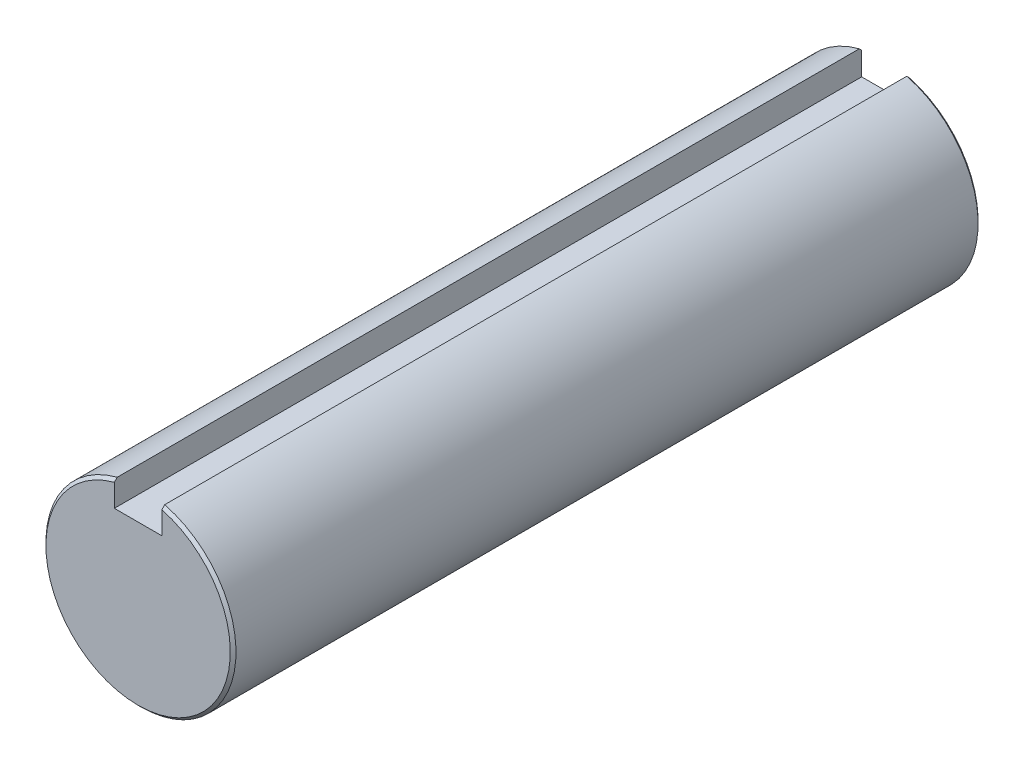
ISO-10303-21;
HEADER;
FILE_DESCRIPTION(('STEP AP214'),'2;1');
FILE_NAME('part.step','',(''),(''),'','','');
FILE_SCHEMA(('AUTOMOTIVE_DESIGN { 1 0 10303 214 1 1 1 1 }'));
ENDSEC;
DATA;
#1=APPLICATION_CONTEXT('core data for automotive mechanical design processes');
#2=APPLICATION_PROTOCOL_DEFINITION('international standard','automotive_design',2000,#1);
#3=PRODUCT_CONTEXT('',#1,'mechanical');
#4=PRODUCT('Part','Part','',(#3));
#5=PRODUCT_RELATED_PRODUCT_CATEGORY('part','',(#4));
#6=PRODUCT_DEFINITION_FORMATION('','',#4);
#7=PRODUCT_DEFINITION_CONTEXT('part definition',#1,'design');
#8=PRODUCT_DEFINITION('design','',#6,#7);
#9=PRODUCT_DEFINITION_SHAPE('','',#8);
#10=(LENGTH_UNIT() NAMED_UNIT(*) SI_UNIT(.MILLI.,.METRE.));
#11=(NAMED_UNIT(*) PLANE_ANGLE_UNIT() SI_UNIT($,.RADIAN.));
#12=(NAMED_UNIT(*) SI_UNIT($,.STERADIAN.) SOLID_ANGLE_UNIT());
#13=UNCERTAINTY_MEASURE_WITH_UNIT(LENGTH_MEASURE(1.E-05),#10,'distance_accuracy_value','');
#14=(GEOMETRIC_REPRESENTATION_CONTEXT(3) GLOBAL_UNCERTAINTY_ASSIGNED_CONTEXT((#13)) GLOBAL_UNIT_ASSIGNED_CONTEXT((#10,
#11,#12)) REPRESENTATION_CONTEXT('',''));
#15=CARTESIAN_POINT('',(0.,0.,0.));
#16=DIRECTION('',(0.,0.,1.));
#17=DIRECTION('',(1.,0.,0.));
#18=AXIS2_PLACEMENT_3D('',#15,#16,#17);
#19=CARTESIAN_POINT('',(0.,0.,150.));
#20=DIRECTION('',(0.,0.,-1.));
#21=DIRECTION('',(0.,-1.,0.));
#22=AXIS2_PLACEMENT_3D('',#19,#20,#21);
#23=CYLINDRICAL_SURFACE('',#22,4.00000000000061);
#24=CARTESIAN_POINT('',(0.,0.,118.64450000006));
#25=DIRECTION('',(0.,0.,-1.));
#26=DIRECTION('',(-1.,0.,0.));
#27=AXIS2_PLACEMENT_3D('',#24,#25,#26);
#28=CIRCLE('',#27,4.00000000000061);
#29=CARTESIAN_POINT('',(1.,3.87298334620806,118.64450000006));
#30=VERTEX_POINT('',#29);
#31=CARTESIAN_POINT('',(-1.,3.87298334620806,118.64450000006));
#32=VERTEX_POINT('',#31);
#33=EDGE_CURVE('E130',#30,#32,#28,.T.);
#34=ORIENTED_EDGE('',*,*,#33,.F.);
#35=DIRECTION('',(0.,0.,-1.));
#36=VECTOR('',#35,1.);
#37=CARTESIAN_POINT('',(1.,3.87298334620806,150.));
#38=LINE('',#37,#36);
#39=CARTESIAN_POINT('',(1.,3.87298334620806,149.88));
#40=VERTEX_POINT('',#39);
#41=EDGE_CURVE('E28',#40,#30,#38,.T.);
#42=ORIENTED_EDGE('',*,*,#41,.F.);
#43=CARTESIAN_POINT('',(0.,0.,149.88));
#44=DIRECTION('',(0.,0.,-1.));
#45=DIRECTION('',(1.,0.,0.));
#46=AXIS2_PLACEMENT_3D('',#43,#44,#45);
#47=CIRCLE('',#46,4.00000000000061);
#48=CARTESIAN_POINT('',(-1.,3.87298334620806,149.88));
#49=VERTEX_POINT('',#48);
#50=EDGE_CURVE('E11',#40,#49,#47,.T.);
#51=ORIENTED_EDGE('',*,*,#50,.T.);
#52=DIRECTION('',(0.,0.,-1.));
#53=VECTOR('',#52,1.);
#54=CARTESIAN_POINT('',(-1.,3.87298334620806,150.));
#55=LINE('',#54,#53);
#56=EDGE_CURVE('E135',#49,#32,#55,.T.);
#57=ORIENTED_EDGE('',*,*,#56,.T.);
#58=EDGE_LOOP('',(#34,#42,#51,#57));
#59=FACE_BOUND('',#58,.T.);
#60=ADVANCED_FACE('F17',(#59),#23,.T.);
#61=CARTESIAN_POINT('',(0.,0.,150.));
#62=DIRECTION('',(0.,0.,-1.));
#63=DIRECTION('',(0.,-1.,0.));
#64=AXIS2_PLACEMENT_3D('',#61,#62,#63);
#65=CONICAL_SURFACE('',#64,3.88000000000056,0.785398163397463);
#66=CARTESIAN_POINT('',(0.,0.,150.));
#67=DIRECTION('',(0.,0.,1.));
#68=DIRECTION('',(1.,0.,0.));
#69=AXIS2_PLACEMENT_3D('',#66,#67,#68);
#70=CIRCLE('',#69,3.88000000000056);
#71=CARTESIAN_POINT('',(-1.,3.74891984443577,150.));
#72=VERTEX_POINT('',#71);
#73=CARTESIAN_POINT('',(1.,3.74891984443577,150.));
#74=VERTEX_POINT('',#73);
#75=EDGE_CURVE('E90',#72,#74,#70,.T.);
#76=ORIENTED_EDGE('',*,*,#75,.F.);
#77=CARTESIAN_POINT('',(-1.,3.87298334620806,149.88));
#78=CARTESIAN_POINT('',(-1.,3.83164949087175,149.920021333338));
#79=CARTESIAN_POINT('',(-1.,3.7902956388451,149.960022026613));
#80=CARTESIAN_POINT('',(-1.,3.74891984443577,150.));
#81=B_SPLINE_CURVE_WITH_KNOTS('',3,(#77,#78,#79,#80),.UNSPECIFIED.,.F.,.F.,(4,4),(0.,
0.000172602875039844),.UNSPECIFIED.);
#82=EDGE_CURVE('E21',#49,#72,#81,.T.);
#83=ORIENTED_EDGE('',*,*,#82,.F.);
#84=ORIENTED_EDGE('',*,*,#50,.F.);
#85=CARTESIAN_POINT('',(1.,3.74891984443577,150.));
#86=CARTESIAN_POINT('',(1.,3.7902956388451,149.960022026613));
#87=CARTESIAN_POINT('',(1.,3.83164949087177,149.920021333338));
#88=CARTESIAN_POINT('',(1.,3.87298334620806,149.88));
#89=B_SPLINE_CURVE_WITH_KNOTS('',3,(#85,#86,#87,#88),.UNSPECIFIED.,.F.,.F.,(4,4),(0.,
0.000172602875039842),.UNSPECIFIED.);
#90=EDGE_CURVE('E88',#74,#40,#89,.T.);
#91=ORIENTED_EDGE('',*,*,#90,.F.);
#92=EDGE_LOOP('',(#76,#83,#84,#91));
#93=FACE_BOUND('',#92,.T.);
#94=ADVANCED_FACE('F19',(#93),#65,.T.);
#95=CARTESIAN_POINT('',(1.,2.80000000000061,150.));
#96=DIRECTION('',(1.,0.,0.));
#97=DIRECTION('',(0.,1.,0.));
#98=AXIS2_PLACEMENT_3D('',#95,#96,#97);
#99=PLANE('',#98);
#100=CARTESIAN_POINT('',(1.,3.76961536499475,118.54450000006));
#101=CARTESIAN_POINT('',(1.,3.82064512787249,118.593823738064));
#102=CARTESIAN_POINT('',(1.,3.87298334620806,118.64450000006));
#103=(BOUNDED_CURVE() B_SPLINE_CURVE(2,(#100,#101,#102),.UNSPECIFIED.,.F.,
.F.) B_SPLINE_CURVE_WITH_KNOTS((3,3),(0.,0.0433749218336261),
.UNSPECIFIED.) CURVE() GEOMETRIC_REPRESENTATION_ITEM() RATIONAL_B_SPLINE_CURVE((1.,
1.00664462116718,1.01315990500497)) REPRESENTATION_ITEM(''));
#104=CARTESIAN_POINT('',(1.,3.76961536499478,118.54450000006));
#105=VERTEX_POINT('',#104);
#106=EDGE_CURVE('E124',#105,#30,#103,.T.);
#107=ORIENTED_EDGE('',*,*,#106,.F.);
#108=DIRECTION('',(0.,1.,0.));
#109=VECTOR('',#108,1.);
#110=CARTESIAN_POINT('',(1.,1.36824583655217,118.54450000006));
#111=LINE('',#110,#109);
#112=CARTESIAN_POINT('',(1.,2.80000000000061,118.54450000006));
#113=VERTEX_POINT('',#112);
#114=EDGE_CURVE('E168',#113,#105,#111,.T.);
#115=ORIENTED_EDGE('',*,*,#114,.F.);
#116=DIRECTION('',(0.,0.,-1.));
#117=VECTOR('',#116,1.);
#118=CARTESIAN_POINT('',(1.,2.80000000000061,150.));
#119=LINE('',#118,#117);
#120=CARTESIAN_POINT('',(1.,2.80000000000061,150.));
#121=VERTEX_POINT('',#120);
#122=EDGE_CURVE('E92',#121,#113,#119,.T.);
#123=ORIENTED_EDGE('',*,*,#122,.F.);
#124=DIRECTION('',(0.,-1.,0.));
#125=VECTOR('',#124,1.);
#126=CARTESIAN_POINT('',(1.,2.80000000000061,150.));
#127=LINE('',#126,#125);
#128=EDGE_CURVE('E91',#74,#121,#127,.T.);
#129=ORIENTED_EDGE('',*,*,#128,.F.);
#130=ORIENTED_EDGE('',*,*,#90,.T.);
#131=ORIENTED_EDGE('',*,*,#41,.T.);
#132=EDGE_LOOP('',(#107,#115,#123,#129,#130,#131));
#133=FACE_BOUND('',#132,.T.);
#134=ADVANCED_FACE('F94',(#133),#99,.F.);
#135=CARTESIAN_POINT('',(1.,2.80000000000061,150.));
#136=DIRECTION('',(0.,-1.,0.));
#137=DIRECTION('',(0.,0.,-1.));
#138=AXIS2_PLACEMENT_3D('',#135,#136,#137);
#139=PLANE('',#138);
#140=DIRECTION('',(1.,0.,0.));
#141=VECTOR('',#140,1.);
#142=CARTESIAN_POINT('',(0.5,2.80000000000061,118.54450000006));
#143=LINE('',#142,#141);
#144=CARTESIAN_POINT('',(-1.,2.80000000000061,118.54450000006));
#145=VERTEX_POINT('',#144);
#146=EDGE_CURVE('E165',#145,#113,#143,.T.);
#147=ORIENTED_EDGE('',*,*,#146,.F.);
#148=DIRECTION('',(0.,0.,-1.));
#149=VECTOR('',#148,1.);
#150=CARTESIAN_POINT('',(-1.,2.80000000000061,150.));
#151=LINE('',#150,#149);
#152=CARTESIAN_POINT('',(-1.,2.80000000000061,150.));
#153=VERTEX_POINT('',#152);
#154=EDGE_CURVE('E102',#153,#145,#151,.T.);
#155=ORIENTED_EDGE('',*,*,#154,.F.);
#156=DIRECTION('',(-1.,0.,0.));
#157=VECTOR('',#156,1.);
#158=CARTESIAN_POINT('',(1.,2.80000000000061,150.));
#159=LINE('',#158,#157);
#160=EDGE_CURVE('E81',#121,#153,#159,.T.);
#161=ORIENTED_EDGE('',*,*,#160,.F.);
#162=ORIENTED_EDGE('',*,*,#122,.T.);
#163=EDGE_LOOP('',(#147,#155,#161,#162));
#164=FACE_BOUND('',#163,.T.);
#165=ADVANCED_FACE('F246',(#164),#139,.F.);
#166=CARTESIAN_POINT('',(0.,0.,150.));
#167=DIRECTION('',(0.,0.,1.));
#168=DIRECTION('',(1.,0.,0.));
#169=AXIS2_PLACEMENT_3D('',#166,#167,#168);
#170=PLANE('',#169);
#171=DIRECTION('',(0.,1.,0.));
#172=VECTOR('',#171,1.);
#173=CARTESIAN_POINT('',(-1.,2.80000000000061,150.));
#174=LINE('',#173,#172);
#175=EDGE_CURVE('E101',#153,#72,#174,.T.);
#176=ORIENTED_EDGE('',*,*,#175,.T.);
#177=ORIENTED_EDGE('',*,*,#75,.T.);
#178=ORIENTED_EDGE('',*,*,#128,.T.);
#179=ORIENTED_EDGE('',*,*,#160,.T.);
#180=EDGE_LOOP('',(#176,#177,#178,#179));
#181=FACE_BOUND('',#180,.T.);
#182=ADVANCED_FACE('F99',(#181),#170,.T.);
#183=CARTESIAN_POINT('',(-1.,2.80000000000061,150.));
#184=DIRECTION('',(-1.,0.,0.));
#185=DIRECTION('',(0.,0.,1.));
#186=AXIS2_PLACEMENT_3D('',#183,#184,#185);
#187=PLANE('',#186);
#188=CARTESIAN_POINT('',(-1.,3.87298334620806,118.64450000006));
#189=CARTESIAN_POINT('',(-1.,3.82064512787148,118.593823738063));
#190=CARTESIAN_POINT('',(-1.,3.76961536499475,118.54450000006));
#191=(BOUNDED_CURVE() B_SPLINE_CURVE(2,(#188,#189,#190),.UNSPECIFIED.,.F.,
.F.) B_SPLINE_CURVE_WITH_KNOTS((3,3),(4.41334186833167,4.45671679016612),
.UNSPECIFIED.) CURVE() GEOMETRIC_REPRESENTATION_ITEM() RATIONAL_B_SPLINE_CURVE((1.01315990500522,
1.00664462116731,1.)) REPRESENTATION_ITEM(''));
#192=CARTESIAN_POINT('',(-1.,3.76961536499478,118.54450000006));
#193=VERTEX_POINT('',#192);
#194=EDGE_CURVE('E148',#32,#193,#191,.T.);
#195=ORIENTED_EDGE('',*,*,#194,.F.);
#196=ORIENTED_EDGE('',*,*,#56,.F.);
#197=ORIENTED_EDGE('',*,*,#82,.T.);
#198=ORIENTED_EDGE('',*,*,#175,.F.);
#199=ORIENTED_EDGE('',*,*,#154,.T.);
#200=DIRECTION('',(0.,-1.,0.));
#201=VECTOR('',#200,1.);
#202=CARTESIAN_POINT('',(-1.,1.36824583655217,118.54450000006));
#203=LINE('',#202,#201);
#204=EDGE_CURVE('E137',#193,#145,#203,.T.);
#205=ORIENTED_EDGE('',*,*,#204,.F.);
#206=EDGE_LOOP('',(#195,#196,#197,#198,#199,#205));
#207=FACE_BOUND('',#206,.T.);
#208=ADVANCED_FACE('F180',(#207),#187,.F.);
#209=CARTESIAN_POINT('',(0.,-0.0635083268962814,118.54450000006));
#210=DIRECTION('',(0.,0.,-1.));
#211=DIRECTION('',(-1.,0.,0.));
#212=AXIS2_PLACEMENT_3D('',#209,#210,#211);
#213=PLANE('',#212);
#214=CARTESIAN_POINT('',(0.,0.,118.54450000006));
#215=DIRECTION('',(0.,0.,1.));
#216=DIRECTION('',(-1.,0.,0.));
#217=AXIS2_PLACEMENT_3D('',#214,#215,#216);
#218=CIRCLE('',#217,3.9000000000006);
#219=EDGE_CURVE('E138',#193,#105,#218,.T.);
#220=ORIENTED_EDGE('',*,*,#219,.F.);
#221=ORIENTED_EDGE('',*,*,#204,.T.);
#222=ORIENTED_EDGE('',*,*,#146,.T.);
#223=ORIENTED_EDGE('',*,*,#114,.T.);
#224=EDGE_LOOP('',(#220,#221,#222,#223));
#225=FACE_BOUND('',#224,.T.);
#226=ADVANCED_FACE('F254',(#225),#213,.T.);
#227=CARTESIAN_POINT('',(0.,0.,118.59450000006));
#228=DIRECTION('',(0.,0.,1.));
#229=DIRECTION('',(0.,-1.,0.));
#230=AXIS2_PLACEMENT_3D('',#227,#228,#229);
#231=CONICAL_SURFACE('',#230,3.95000000000061,0.785398163397459);
#232=ORIENTED_EDGE('',*,*,#194,.T.);
#233=ORIENTED_EDGE('',*,*,#219,.T.);
#234=ORIENTED_EDGE('',*,*,#106,.T.);
#235=ORIENTED_EDGE('',*,*,#33,.T.);
#236=EDGE_LOOP('',(#232,#233,#234,#235));
#237=FACE_BOUND('',#236,.T.);
#238=ADVANCED_FACE('F139',(#237),#231,.T.);
#239=CLOSED_SHELL('',(#60,#94,#134,#165,#182,#208,#226,#238));
#240=MANIFOLD_SOLID_BREP('B1',#239);
#241=ADVANCED_BREP_SHAPE_REPRESENTATION('',(#18,#240),#14);
#242=SHAPE_DEFINITION_REPRESENTATION(#9,#241);
ENDSEC;
END-ISO-10303-21;
